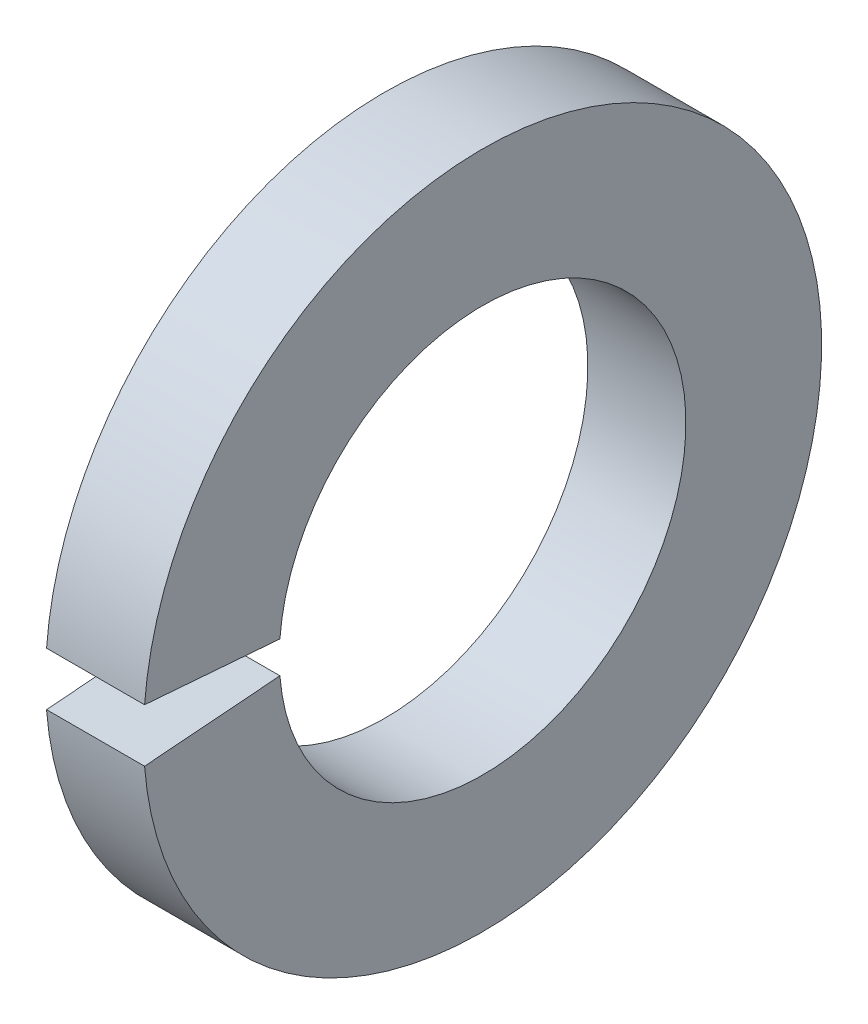
ISO-10303-21;
HEADER;
FILE_DESCRIPTION(('STEP AP214'),'2;1');
FILE_NAME('part.step','',(''),(''),'','','');
FILE_SCHEMA(('AUTOMOTIVE_DESIGN { 1 0 10303 214 1 1 1 1 }'));
ENDSEC;
DATA;
#1=APPLICATION_CONTEXT('core data for automotive mechanical design processes');
#2=APPLICATION_PROTOCOL_DEFINITION('international standard','automotive_design',2000,#1);
#3=PRODUCT_CONTEXT('',#1,'mechanical');
#4=PRODUCT('Part','Part','',(#3));
#5=PRODUCT_RELATED_PRODUCT_CATEGORY('part','',(#4));
#6=PRODUCT_DEFINITION_FORMATION('','',#4);
#7=PRODUCT_DEFINITION_CONTEXT('part definition',#1,'design');
#8=PRODUCT_DEFINITION('design','',#6,#7);
#9=PRODUCT_DEFINITION_SHAPE('','',#8);
#10=(LENGTH_UNIT() NAMED_UNIT(*) SI_UNIT(.MILLI.,.METRE.));
#11=(NAMED_UNIT(*) PLANE_ANGLE_UNIT() SI_UNIT($,.RADIAN.));
#12=(NAMED_UNIT(*) SI_UNIT($,.STERADIAN.) SOLID_ANGLE_UNIT());
#13=UNCERTAINTY_MEASURE_WITH_UNIT(LENGTH_MEASURE(1.E-05),#10,'distance_accuracy_value','');
#14=(GEOMETRIC_REPRESENTATION_CONTEXT(3) GLOBAL_UNCERTAINTY_ASSIGNED_CONTEXT((#13)) GLOBAL_UNIT_ASSIGNED_CONTEXT((#10,
#11,#12)) REPRESENTATION_CONTEXT('',''));
#15=CARTESIAN_POINT('',(0.,0.,0.));
#16=DIRECTION('',(0.,0.,1.));
#17=DIRECTION('',(1.,0.,0.));
#18=AXIS2_PLACEMENT_3D('',#15,#16,#17);
#19=CARTESIAN_POINT('',(-34.9249999999999,0.,0.));
#20=DIRECTION('',(-1.,0.,0.));
#21=DIRECTION('',(0.,0.,1.));
#22=AXIS2_PLACEMENT_3D('',#19,#20,#21);
#23=CYLINDRICAL_SURFACE('',#22,8.2169);
#24=CARTESIAN_POINT('',(0.,0.,0.));
#25=DIRECTION('',(-1.,0.,0.));
#26=DIRECTION('',(0.,0.,1.));
#27=AXIS2_PLACEMENT_3D('',#24,#25,#26);
#28=CIRCLE('',#27,8.2169);
#29=CARTESIAN_POINT('',(0.,0.644690543686135,8.19157003955174));
#30=VERTEX_POINT('',#29);
#31=CARTESIAN_POINT('',(0.,-0.644690543686135,8.19157003955174));
#32=VERTEX_POINT('',#31);
#33=EDGE_CURVE('E85',#30,#32,#28,.T.);
#34=ORIENTED_EDGE('',*,*,#33,.F.);
#35=DIRECTION('',(-1.,0.,0.));
#36=VECTOR('',#35,1.);
#37=CARTESIAN_POINT('',(-34.9249999999999,0.644690543686135,8.19157003955174));
#38=LINE('',#37,#36);
#39=CARTESIAN_POINT('',(-3.9624,0.644690543686135,8.19157003955174));
#40=VERTEX_POINT('',#39);
#41=EDGE_CURVE('E99',#30,#40,#38,.T.);
#42=ORIENTED_EDGE('',*,*,#41,.T.);
#43=CARTESIAN_POINT('',(-3.9624,0.,0.));
#44=DIRECTION('',(-1.,0.,0.));
#45=DIRECTION('',(0.,0.,1.));
#46=AXIS2_PLACEMENT_3D('',#43,#44,#45);
#47=CIRCLE('',#46,8.2169);
#48=CARTESIAN_POINT('',(-3.9624,-0.644690543686132,8.19157003955174));
#49=VERTEX_POINT('',#48);
#50=EDGE_CURVE('E87',#40,#49,#47,.T.);
#51=ORIENTED_EDGE('',*,*,#50,.T.);
#52=DIRECTION('',(-1.,0.,0.));
#53=VECTOR('',#52,1.);
#54=CARTESIAN_POINT('',(-34.9249999999999,-0.644690543686135,8.19157003955174));
#55=LINE('',#54,#53);
#56=EDGE_CURVE('E55',#32,#49,#55,.T.);
#57=ORIENTED_EDGE('',*,*,#56,.F.);
#58=EDGE_LOOP('',(#34,#42,#51,#57));
#59=FACE_BOUND('',#58,.T.);
#60=ADVANCED_FACE('F34',(#59),#23,.F.);
#61=CARTESIAN_POINT('',(0.,8.2169,0.));
#62=DIRECTION('',(-1.,0.,0.));
#63=DIRECTION('',(0.,0.,1.));
#64=AXIS2_PLACEMENT_3D('',#61,#62,#63);
#65=PLANE('',#64);
#66=CARTESIAN_POINT('',(0.,0.,0.));
#67=DIRECTION('',(-1.,0.,0.));
#68=DIRECTION('',(0.,0.,1.));
#69=AXIS2_PLACEMENT_3D('',#66,#67,#68);
#70=CIRCLE('',#69,13.7033);
#71=CARTESIAN_POINT('',(0.,1.07514852648739,13.6610572993452));
#72=VERTEX_POINT('',#71);
#73=CARTESIAN_POINT('',(0.,-1.07514852648739,13.6610572993452));
#74=VERTEX_POINT('',#73);
#75=EDGE_CURVE('E91',#72,#74,#70,.T.);
#76=ORIENTED_EDGE('',*,*,#75,.F.);
#77=DIRECTION('',(0.,0.0784590957278456,0.996917333733128));
#78=VECTOR('',#77,1.);
#79=CARTESIAN_POINT('',(0.,0.,0.));
#80=LINE('',#79,#78);
#81=EDGE_CURVE('E79',#30,#72,#80,.T.);
#82=ORIENTED_EDGE('',*,*,#81,.F.);
#83=ORIENTED_EDGE('',*,*,#33,.T.);
#84=DIRECTION('',(0.,-0.0784590957278456,0.996917333733128));
#85=VECTOR('',#84,1.);
#86=CARTESIAN_POINT('',(0.,0.,0.));
#87=LINE('',#86,#85);
#88=EDGE_CURVE('E71',#32,#74,#87,.T.);
#89=ORIENTED_EDGE('',*,*,#88,.T.);
#90=EDGE_LOOP('',(#76,#82,#83,#89));
#91=FACE_BOUND('',#90,.T.);
#92=ADVANCED_FACE('F90',(#91),#65,.F.);
#93=CARTESIAN_POINT('',(-34.9249999999999,0.,0.));
#94=DIRECTION('',(-1.,0.,0.));
#95=DIRECTION('',(0.,0.,1.));
#96=AXIS2_PLACEMENT_3D('',#93,#94,#95);
#97=CYLINDRICAL_SURFACE('',#96,13.7033);
#98=CARTESIAN_POINT('',(-3.9624,0.,0.));
#99=DIRECTION('',(-1.,0.,0.));
#100=DIRECTION('',(0.,0.,1.));
#101=AXIS2_PLACEMENT_3D('',#98,#99,#100);
#102=CIRCLE('',#101,13.7033);
#103=CARTESIAN_POINT('',(-3.9624,1.07514852648739,13.6610572993452));
#104=VERTEX_POINT('',#103);
#105=CARTESIAN_POINT('',(-3.9624,-1.07514852648739,13.6610572993452));
#106=VERTEX_POINT('',#105);
#107=EDGE_CURVE('E93',#104,#106,#102,.T.);
#108=ORIENTED_EDGE('',*,*,#107,.F.);
#109=DIRECTION('',(-1.,0.,0.));
#110=VECTOR('',#109,1.);
#111=CARTESIAN_POINT('',(-34.9249999999999,1.07514852648739,13.6610572993452));
#112=LINE('',#111,#110);
#113=EDGE_CURVE('E48',#104,#72,#112,.F.);
#114=ORIENTED_EDGE('',*,*,#113,.T.);
#115=ORIENTED_EDGE('',*,*,#75,.T.);
#116=DIRECTION('',(-1.,0.,0.));
#117=VECTOR('',#116,1.);
#118=CARTESIAN_POINT('',(-34.9249999999999,-1.07514852648739,13.6610572993452));
#119=LINE('',#118,#117);
#120=EDGE_CURVE('E74',#106,#74,#119,.F.);
#121=ORIENTED_EDGE('',*,*,#120,.F.);
#122=EDGE_LOOP('',(#108,#114,#115,#121));
#123=FACE_BOUND('',#122,.T.);
#124=ADVANCED_FACE('F106',(#123),#97,.T.);
#125=CARTESIAN_POINT('',(-3.9624,13.7033,0.));
#126=DIRECTION('',(1.,0.,0.));
#127=DIRECTION('',(0.,0.,-1.));
#128=AXIS2_PLACEMENT_3D('',#125,#126,#127);
#129=PLANE('',#128);
#130=ORIENTED_EDGE('',*,*,#50,.F.);
#131=DIRECTION('',(0.,0.0784590957278456,0.996917333733128));
#132=VECTOR('',#131,1.);
#133=CARTESIAN_POINT('',(-3.9624,0.0843551811613285,1.07183420239291));
#134=LINE('',#133,#132);
#135=EDGE_CURVE('E11',#40,#104,#134,.T.);
#136=ORIENTED_EDGE('',*,*,#135,.T.);
#137=ORIENTED_EDGE('',*,*,#107,.T.);
#138=DIRECTION('',(0.,-0.0784590957278456,0.996917333733128));
#139=VECTOR('',#138,1.);
#140=CARTESIAN_POINT('',(-3.9624,0.0843551811613285,-1.07183420239291));
#141=LINE('',#140,#139);
#142=EDGE_CURVE('E41',#49,#106,#141,.T.);
#143=ORIENTED_EDGE('',*,*,#142,.F.);
#144=EDGE_LOOP('',(#130,#136,#137,#143));
#145=FACE_BOUND('',#144,.T.);
#146=ADVANCED_FACE('F108',(#145),#129,.F.);
#147=CARTESIAN_POINT('',(-3.9624,0.,0.));
#148=DIRECTION('',(0.,0.996917333733128,0.0784590957278456));
#149=DIRECTION('',(0.,-0.0784590957278456,0.996917333733128));
#150=AXIS2_PLACEMENT_3D('',#147,#148,#149);
#151=PLANE('',#150);
#152=ORIENTED_EDGE('',*,*,#56,.T.);
#153=ORIENTED_EDGE('',*,*,#142,.T.);
#154=ORIENTED_EDGE('',*,*,#120,.T.);
#155=ORIENTED_EDGE('',*,*,#88,.F.);
#156=EDGE_LOOP('',(#152,#153,#154,#155));
#157=FACE_BOUND('',#156,.T.);
#158=ADVANCED_FACE('F72',(#157),#151,.T.);
#159=CARTESIAN_POINT('',(-3.9624,0.,0.));
#160=DIRECTION('',(0.,0.996917333733128,-0.0784590957278456));
#161=DIRECTION('',(0.,0.0784590957278456,0.996917333733128));
#162=AXIS2_PLACEMENT_3D('',#159,#160,#161);
#163=PLANE('',#162);
#164=ORIENTED_EDGE('',*,*,#81,.T.);
#165=ORIENTED_EDGE('',*,*,#113,.F.);
#166=ORIENTED_EDGE('',*,*,#135,.F.);
#167=ORIENTED_EDGE('',*,*,#41,.F.);
#168=EDGE_LOOP('',(#164,#165,#166,#167));
#169=FACE_BOUND('',#168,.T.);
#170=ADVANCED_FACE('F103',(#169),#163,.F.);
#171=CLOSED_SHELL('',(#60,#92,#124,#146,#158,#170));
#172=MANIFOLD_SOLID_BREP('B2',#171);
#173=ADVANCED_BREP_SHAPE_REPRESENTATION('',(#18,#172),#14);
#174=SHAPE_DEFINITION_REPRESENTATION(#9,#173);
ENDSEC;
END-ISO-10303-21;
